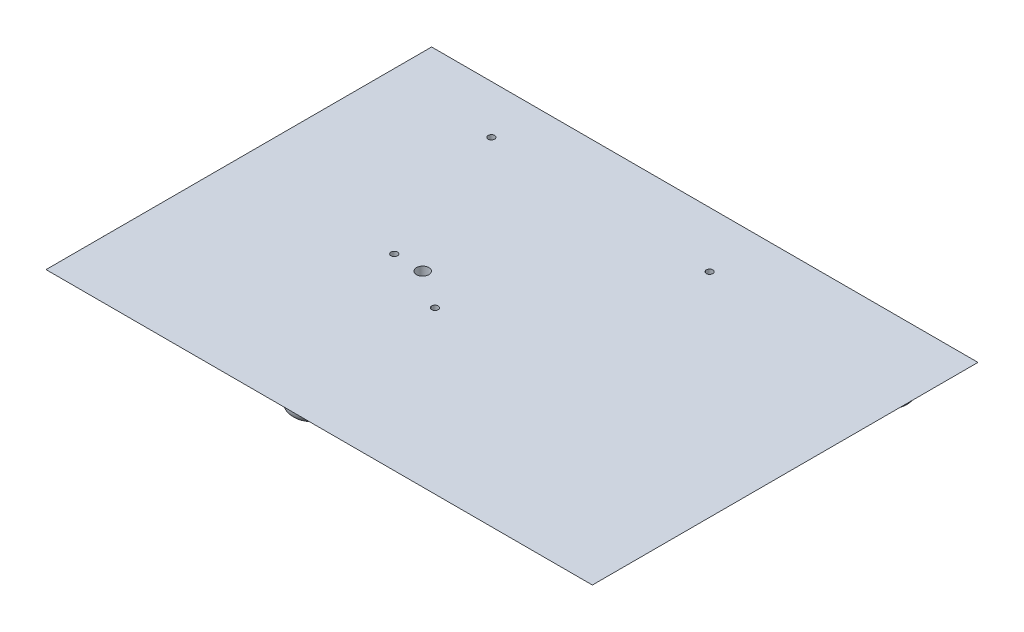
ISO-10303-21;
HEADER;
FILE_DESCRIPTION(('STEP AP214'),'2;1');
FILE_NAME('part.step','',(''),(''),'','','');
FILE_SCHEMA(('AUTOMOTIVE_DESIGN { 1 0 10303 214 1 1 1 1 }'));
ENDSEC;
DATA;
#1=APPLICATION_CONTEXT('core data for automotive mechanical design processes');
#2=APPLICATION_PROTOCOL_DEFINITION('international standard','automotive_design',2000,#1);
#3=PRODUCT_CONTEXT('',#1,'mechanical');
#4=PRODUCT('Part','Part','',(#3));
#5=PRODUCT_RELATED_PRODUCT_CATEGORY('part','',(#4));
#6=PRODUCT_DEFINITION_FORMATION('','',#4);
#7=PRODUCT_DEFINITION_CONTEXT('part definition',#1,'design');
#8=PRODUCT_DEFINITION('design','',#6,#7);
#9=PRODUCT_DEFINITION_SHAPE('','',#8);
#10=(LENGTH_UNIT() NAMED_UNIT(*) SI_UNIT(.MILLI.,.METRE.));
#11=(NAMED_UNIT(*) PLANE_ANGLE_UNIT() SI_UNIT($,.RADIAN.));
#12=(NAMED_UNIT(*) SI_UNIT($,.STERADIAN.) SOLID_ANGLE_UNIT());
#13=UNCERTAINTY_MEASURE_WITH_UNIT(LENGTH_MEASURE(1.E-05),#10,'distance_accuracy_value','');
#14=(GEOMETRIC_REPRESENTATION_CONTEXT(3) GLOBAL_UNCERTAINTY_ASSIGNED_CONTEXT((#13)) GLOBAL_UNIT_ASSIGNED_CONTEXT((#10,
#11,#12)) REPRESENTATION_CONTEXT('',''));
#15=CARTESIAN_POINT('',(0.,0.,0.));
#16=DIRECTION('',(0.,0.,1.));
#17=DIRECTION('',(1.,0.,0.));
#18=AXIS2_PLACEMENT_3D('',#15,#16,#17);
#19=CARTESIAN_POINT('',(0.,0.,0.));
#20=DIRECTION('',(0.,-1.,0.));
#21=DIRECTION('',(0.,0.,-1.));
#22=AXIS2_PLACEMENT_3D('',#19,#20,#21);
#23=PLANE('',#22);
#24=CARTESIAN_POINT('',(0.243499550899023,0.,-11.7520668416682));
#25=DIRECTION('',(0.,-1.,0.));
#26=DIRECTION('',(0.,0.,-1.));
#27=AXIS2_PLACEMENT_3D('',#24,#25,#26);
#28=CIRCLE('',#27,9.9);
#29=CARTESIAN_POINT('',(0.243499550899023,0.,-21.6520668416682));
#30=VERTEX_POINT('',#29);
#31=EDGE_CURVE('E336',#30,#30,#28,.T.);
#32=ORIENTED_EDGE('',*,*,#31,.F.);
#33=EDGE_LOOP('',(#32));
#34=FACE_BOUND('',#33,.T.);
#35=CARTESIAN_POINT('',(78.4618535037038,0.,130.95272228954));
#36=DIRECTION('',(0.,-1.,0.));
#37=DIRECTION('',(0.,0.,-1.));
#38=AXIS2_PLACEMENT_3D('',#35,#36,#37);
#39=CIRCLE('',#38,9.9);
#40=CARTESIAN_POINT('',(78.4618535037038,0.,121.05272228954));
#41=VERTEX_POINT('',#40);
#42=EDGE_CURVE('E332',#41,#41,#39,.T.);
#43=ORIENTED_EDGE('',*,*,#42,.F.);
#44=EDGE_LOOP('',(#43));
#45=FACE_BOUND('',#44,.T.);
#46=CARTESIAN_POINT('',(210.683499550899,0.,-11.7520668416682));
#47=DIRECTION('',(0.,-1.,0.));
#48=DIRECTION('',(0.,0.,-1.));
#49=AXIS2_PLACEMENT_3D('',#46,#47,#48);
#50=CIRCLE('',#49,9.89999999999998);
#51=CARTESIAN_POINT('',(210.683499550899,0.,-21.6520668416682));
#52=VERTEX_POINT('',#51);
#53=EDGE_CURVE('E317',#52,#52,#50,.T.);
#54=ORIENTED_EDGE('',*,*,#53,.F.);
#55=EDGE_LOOP('',(#54));
#56=FACE_BOUND('',#55,.T.);
#57=CARTESIAN_POINT('',(84.013499550899,0.,77.7455088721633));
#58=DIRECTION('',(0.,1.,0.));
#59=DIRECTION('',(0.,0.,1.));
#60=AXIS2_PLACEMENT_3D('',#57,#58,#59);
#61=CIRCLE('',#60,1.56379290432816);
#62=CARTESIAN_POINT('',(84.013499550899,0.,79.3093017764915));
#63=VERTEX_POINT('',#62);
#64=EDGE_CURVE('E328',#63,#63,#61,.T.);
#65=ORIENTED_EDGE('',*,*,#64,.T.);
#66=EDGE_LOOP('',(#65));
#67=FACE_BOUND('',#66,.T.);
#68=CARTESIAN_POINT('',(134.473825946548,0.,-2.47404936094142));
#69=DIRECTION('',(0.,1.,0.));
#70=DIRECTION('',(0.,0.,1.));
#71=AXIS2_PLACEMENT_3D('',#68,#69,#70);
#72=CIRCLE('',#71,1.56);
#73=CARTESIAN_POINT('',(134.473825946548,0.,-0.914049360941417));
#74=VERTEX_POINT('',#73);
#75=EDGE_CURVE('E323',#74,#74,#72,.T.);
#76=ORIENTED_EDGE('',*,*,#75,.T.);
#77=EDGE_LOOP('',(#76));
#78=FACE_BOUND('',#77,.T.);
#79=CARTESIAN_POINT('',(65.974334740333,0.,65.5479331583318));
#80=DIRECTION('',(0.,-1.,0.));
#81=DIRECTION('',(0.,0.,-1.));
#82=AXIS2_PLACEMENT_3D('',#79,#80,#81);
#83=CIRCLE('',#82,5.43);
#84=CARTESIAN_POINT('',(65.974334740333,0.,60.1179331583318));
#85=VERTEX_POINT('',#84);
#86=EDGE_CURVE('E313',#85,#85,#83,.T.);
#87=ORIENTED_EDGE('',*,*,#86,.F.);
#88=EDGE_LOOP('',(#87));
#89=FACE_BOUND('',#88,.T.);
#90=CARTESIAN_POINT('',(52.1254035342072,0.,65.2409534743744));
#91=DIRECTION('',(0.,-1.,0.));
#92=DIRECTION('',(0.,0.,-1.));
#93=AXIS2_PLACEMENT_3D('',#90,#91,#92);
#94=CIRCLE('',#93,3.67500000000002);
#95=CARTESIAN_POINT('',(52.1254035342072,0.,61.5659534743744));
#96=VERTEX_POINT('',#95);
#97=EDGE_CURVE('E260',#96,#96,#94,.T.);
#98=ORIENTED_EDGE('',*,*,#97,.F.);
#99=EDGE_LOOP('',(#98));
#100=FACE_BOUND('',#99,.T.);
#101=DIRECTION('',(0.,0.,-1.));
#102=VECTOR('',#101,1.);
#103=CARTESIAN_POINT('',(30.7649196414561,0.,0.));
#104=LINE('',#103,#102);
#105=CARTESIAN_POINT('',(30.7649196414561,0.,-5.2203576567237));
#106=VERTEX_POINT('',#105);
#107=CARTESIAN_POINT('',(30.7649196414561,0.,-6.68377602661267));
#108=VERTEX_POINT('',#107);
#109=EDGE_CURVE('E128',#106,#108,#104,.T.);
#110=ORIENTED_EDGE('',*,*,#109,.T.);
#111=CARTESIAN_POINT('',(27.163499550899,0.,-5.95206684166818));
#112=DIRECTION('',(0.,1.,0.));
#113=DIRECTION('',(0.,0.,1.));
#114=AXIS2_PLACEMENT_3D('',#111,#112,#113);
#115=CIRCLE('',#114,3.675);
#116=EDGE_CURVE('E64',#108,#106,#115,.T.);
#117=ORIENTED_EDGE('',*,*,#116,.T.);
#118=EDGE_LOOP('',(#110,#117));
#119=FACE_BOUND('',#118,.T.);
#120=DIRECTION('',(1.,0.,0.));
#121=VECTOR('',#120,1.);
#122=CARTESIAN_POINT('',(-18.536500449101,0.,-26.9520668416681));
#123=LINE('',#122,#121);
#124=CARTESIAN_POINT('',(-18.536500449101,0.,-26.9520668416681));
#125=VERTEX_POINT('',#124);
#126=CARTESIAN_POINT('',(229.463499550899,0.,-26.9520668416681));
#127=VERTEX_POINT('',#126);
#128=EDGE_CURVE('E300',#125,#127,#123,.T.);
#129=ORIENTED_EDGE('',*,*,#128,.T.);
#130=DIRECTION('',(0.,0.,1.));
#131=VECTOR('',#130,1.);
#132=CARTESIAN_POINT('',(229.463499550899,0.,-26.9520668416681));
#133=LINE('',#132,#131);
#134=CARTESIAN_POINT('',(229.463499550899,0.,148.047933158332));
#135=VERTEX_POINT('',#134);
#136=EDGE_CURVE('E292',#127,#135,#133,.T.);
#137=ORIENTED_EDGE('',*,*,#136,.T.);
#138=DIRECTION('',(1.,0.,0.));
#139=VECTOR('',#138,1.);
#140=CARTESIAN_POINT('',(-18.536500449101,0.,148.047933158332));
#141=LINE('',#140,#139);
#142=CARTESIAN_POINT('',(-18.536500449101,0.,148.047933158332));
#143=VERTEX_POINT('',#142);
#144=EDGE_CURVE('E261',#143,#135,#141,.T.);
#145=ORIENTED_EDGE('',*,*,#144,.F.);
#146=DIRECTION('',(0.,0.,1.));
#147=VECTOR('',#146,1.);
#148=CARTESIAN_POINT('',(-18.536500449101,0.,-26.9520668416681));
#149=LINE('',#148,#147);
#150=EDGE_CURVE('E72',#125,#143,#149,.T.);
#151=ORIENTED_EDGE('',*,*,#150,.F.);
#152=EDGE_LOOP('',(#129,#137,#145,#151));
#153=FACE_BOUND('',#152,.T.);
#154=ADVANCED_FACE('F49',(#34,#45,#56,#67,#78,#89,#100,#119,#153),#23,.T.);
#155=CARTESIAN_POINT('',(0.,6.,0.));
#156=DIRECTION('',(0.,1.,0.));
#157=DIRECTION('',(0.,0.,1.));
#158=AXIS2_PLACEMENT_3D('',#155,#156,#157);
#159=PLANE('',#158);
#160=CARTESIAN_POINT('',(84.013499550899,6.,77.7455088721633));
#161=DIRECTION('',(0.,1.,0.));
#162=DIRECTION('',(0.,0.,1.));
#163=AXIS2_PLACEMENT_3D('',#160,#161,#162);
#164=CIRCLE('',#163,1.56379290432816);
#165=CARTESIAN_POINT('',(84.013499550899,6.,79.3093017764915));
#166=VERTEX_POINT('',#165);
#167=EDGE_CURVE('E324',#166,#166,#164,.F.);
#168=ORIENTED_EDGE('',*,*,#167,.T.);
#169=EDGE_LOOP('',(#168));
#170=FACE_BOUND('',#169,.T.);
#171=CARTESIAN_POINT('',(134.473825946548,6.,-2.47404936094142));
#172=DIRECTION('',(0.,1.,0.));
#173=DIRECTION('',(0.,0.,1.));
#174=AXIS2_PLACEMENT_3D('',#171,#172,#173);
#175=CIRCLE('',#174,1.56);
#176=CARTESIAN_POINT('',(134.473825946548,6.,-0.914049360941417));
#177=VERTEX_POINT('',#176);
#178=EDGE_CURVE('E318',#177,#177,#175,.F.);
#179=ORIENTED_EDGE('',*,*,#178,.T.);
#180=EDGE_LOOP('',(#179));
#181=FACE_BOUND('',#180,.T.);
#182=CARTESIAN_POINT('',(27.163499550899,6.,-5.95206684166818));
#183=DIRECTION('',(0.,1.,0.));
#184=DIRECTION('',(0.,0.,1.));
#185=AXIS2_PLACEMENT_3D('',#182,#183,#184);
#186=CIRCLE('',#185,1.56);
#187=CARTESIAN_POINT('',(27.163499550899,6.,-4.39206684166818));
#188=VERTEX_POINT('',#187);
#189=EDGE_CURVE('E137',#188,#188,#186,.T.);
#190=ORIENTED_EDGE('',*,*,#189,.F.);
#191=EDGE_LOOP('',(#190));
#192=FACE_BOUND('',#191,.T.);
#193=CARTESIAN_POINT('',(65.974334740333,6.,65.5479331583318));
#194=DIRECTION('',(0.,1.,0.));
#195=DIRECTION('',(0.,0.,1.));
#196=AXIS2_PLACEMENT_3D('',#193,#194,#195);
#197=CIRCLE('',#196,2.94691911101702);
#198=CARTESIAN_POINT('',(65.974334740333,6.,68.4948522693488));
#199=VERTEX_POINT('',#198);
#200=EDGE_CURVE('E135',#199,#199,#197,.T.);
#201=ORIENTED_EDGE('',*,*,#200,.F.);
#202=EDGE_LOOP('',(#201));
#203=FACE_BOUND('',#202,.T.);
#204=CARTESIAN_POINT('',(52.1254035342072,6.,65.2409534743744));
#205=DIRECTION('',(0.,1.,0.));
#206=DIRECTION('',(0.,0.,1.));
#207=AXIS2_PLACEMENT_3D('',#204,#205,#206);
#208=CIRCLE('',#207,1.56416969477706);
#209=CARTESIAN_POINT('',(52.1254035342072,6.,66.8051231691515));
#210=VERTEX_POINT('',#209);
#211=EDGE_CURVE('E141',#210,#210,#208,.T.);
#212=ORIENTED_EDGE('',*,*,#211,.F.);
#213=EDGE_LOOP('',(#212));
#214=FACE_BOUND('',#213,.T.);
#215=DIRECTION('',(0.,0.,1.));
#216=VECTOR('',#215,1.);
#217=CARTESIAN_POINT('',(-24.2854326907217,6.,154.54079231546));
#218=LINE('',#217,#216);
#219=CARTESIAN_POINT('',(-24.2854326907217,6.,-28.9592076845402));
#220=VERTEX_POINT('',#219);
#221=CARTESIAN_POINT('',(-24.2854326907217,6.,154.54079231546));
#222=VERTEX_POINT('',#221);
#223=EDGE_CURVE('E148',#220,#222,#218,.T.);
#224=ORIENTED_EDGE('',*,*,#223,.T.);
#225=DIRECTION('',(1.,0.,0.));
#226=VECTOR('',#225,1.);
#227=CARTESIAN_POINT('',(235.714567309278,6.,154.54079231546));
#228=LINE('',#227,#226);
#229=CARTESIAN_POINT('',(235.714567309278,6.,154.54079231546));
#230=VERTEX_POINT('',#229);
#231=EDGE_CURVE('E153',#222,#230,#228,.T.);
#232=ORIENTED_EDGE('',*,*,#231,.T.);
#233=DIRECTION('',(0.,0.,-1.));
#234=VECTOR('',#233,1.);
#235=CARTESIAN_POINT('',(235.714567309278,6.,154.54079231546));
#236=LINE('',#235,#234);
#237=CARTESIAN_POINT('',(235.714567309278,6.,-28.9592076845402));
#238=VERTEX_POINT('',#237);
#239=EDGE_CURVE('E197',#230,#238,#236,.T.);
#240=ORIENTED_EDGE('',*,*,#239,.T.);
#241=DIRECTION('',(-1.,0.,0.));
#242=VECTOR('',#241,1.);
#243=CARTESIAN_POINT('',(235.714567309278,6.,-28.9592076845402));
#244=LINE('',#243,#242);
#245=EDGE_CURVE('E236',#238,#220,#244,.T.);
#246=ORIENTED_EDGE('',*,*,#245,.T.);
#247=EDGE_LOOP('',(#224,#232,#240,#246));
#248=FACE_BOUND('',#247,.T.);
#249=ADVANCED_FACE('F210',(#170,#181,#192,#203,#214,#248),#159,.T.);
#250=CARTESIAN_POINT('',(110.031204318135,-114.635418954789,0.));
#251=DIRECTION('',(-0.692470261061307,0.721446420426136,0.));
#252=DIRECTION('',(-0.721446420426136,-0.692470261061307,0.));
#253=AXIS2_PLACEMENT_3D('',#250,#251,#252);
#254=PLANE('',#253);
#255=DIRECTION('',(-0.577336667217422,-0.554148529051084,-0.599668058543057));
#256=VECTOR('',#255,1.);
#257=CARTESIAN_POINT('',(235.714567309278,6.,154.54079231546));
#258=LINE('',#257,#256);
#259=EDGE_CURVE('E196',#230,#135,#258,.T.);
#260=ORIENTED_EDGE('',*,*,#259,.T.);
#261=ORIENTED_EDGE('',*,*,#136,.F.);
#262=DIRECTION('',(-0.702835540593864,-0.674606868228304,0.225671833017172));
#263=VECTOR('',#262,1.);
#264=CARTESIAN_POINT('',(235.714567309278,6.,-28.9592076845402));
#265=LINE('',#264,#263);
#266=EDGE_CURVE('E502',#238,#127,#265,.T.);
#267=ORIENTED_EDGE('',*,*,#266,.F.);
#268=ORIENTED_EDGE('',*,*,#239,.F.);
#269=EDGE_LOOP('',(#260,#261,#267,#268));
#270=FACE_BOUND('',#269,.T.);
#271=ADVANCED_FACE('F219',(#270),#254,.F.);
#272=CARTESIAN_POINT('',(0.,-8.10868849972943,-24.2395201966792));
#273=DIRECTION('',(0.,0.317243381230876,0.948344155391491));
#274=DIRECTION('',(0.,-0.948344155391491,0.317243381230876));
#275=AXIS2_PLACEMENT_3D('',#272,#273,#274);
#276=PLANE('',#275);
#277=ORIENTED_EDGE('',*,*,#266,.T.);
#278=ORIENTED_EDGE('',*,*,#128,.F.);
#279=DIRECTION('',(0.672498590587613,-0.701867994601402,0.234791319711528));
#280=VECTOR('',#279,1.);
#281=CARTESIAN_POINT('',(-24.2854326907217,6.,-28.9592076845402));
#282=LINE('',#281,#280);
#283=EDGE_CURVE('E494',#220,#125,#282,.T.);
#284=ORIENTED_EDGE('',*,*,#283,.F.);
#285=ORIENTED_EDGE('',*,*,#245,.F.);
#286=EDGE_LOOP('',(#277,#278,#284,#285));
#287=FACE_BOUND('',#286,.T.);
#288=ADVANCED_FACE('F172',(#287),#276,.F.);
#289=CARTESIAN_POINT('',(0.,-73.7939024504005,68.1923639474496));
#290=DIRECTION('',(0.,0.73443172803957,-0.678682574440225));
#291=DIRECTION('',(0.,0.678682574440225,0.73443172803957));
#292=AXIS2_PLACEMENT_3D('',#289,#290,#291);
#293=PLANE('',#292);
#294=DIRECTION('',(0.545155332398835,-0.568963393012764,-0.615699862732256));
#295=VECTOR('',#294,1.);
#296=CARTESIAN_POINT('',(-24.2854326907217,6.,154.54079231546));
#297=LINE('',#296,#295);
#298=EDGE_CURVE('E159',#222,#143,#297,.T.);
#299=ORIENTED_EDGE('',*,*,#298,.T.);
#300=ORIENTED_EDGE('',*,*,#144,.T.);
#301=ORIENTED_EDGE('',*,*,#259,.F.);
#302=ORIENTED_EDGE('',*,*,#231,.F.);
#303=EDGE_LOOP('',(#299,#300,#301,#302));
#304=FACE_BOUND('',#303,.T.);
#305=ADVANCED_FACE('F161',(#304),#293,.F.);
#306=CARTESIAN_POINT('',(-9.66418351200792,-9.25978936352028,0.));
#307=DIRECTION('',(-0.722052391989645,-0.691838379408105,0.));
#308=DIRECTION('',(0.691838379408105,-0.722052391989645,0.));
#309=AXIS2_PLACEMENT_3D('',#306,#307,#308);
#310=PLANE('',#309);
#311=ORIENTED_EDGE('',*,*,#283,.T.);
#312=ORIENTED_EDGE('',*,*,#150,.T.);
#313=ORIENTED_EDGE('',*,*,#298,.F.);
#314=ORIENTED_EDGE('',*,*,#223,.F.);
#315=EDGE_LOOP('',(#311,#312,#313,#314));
#316=FACE_BOUND('',#315,.T.);
#317=ADVANCED_FACE('F171',(#316),#310,.T.);
#318=CARTESIAN_POINT('',(52.1254035342072,6.,65.2409534743744));
#319=DIRECTION('',(0.,-1.,0.));
#320=DIRECTION('',(0.,0.,-1.));
#321=AXIS2_PLACEMENT_3D('',#318,#319,#320);
#322=CYLINDRICAL_SURFACE('',#321,1.56416969477706);
#323=ORIENTED_EDGE('',*,*,#211,.T.);
#324=EDGE_LOOP('',(#323));
#325=FACE_BOUND('',#324,.T.);
#326=CARTESIAN_POINT('',(52.1254035342072,-1.,65.2409534743744));
#327=DIRECTION('',(0.,1.,0.));
#328=DIRECTION('',(0.,0.,1.));
#329=AXIS2_PLACEMENT_3D('',#326,#327,#328);
#330=CIRCLE('',#329,1.56416969477706);
#331=CARTESIAN_POINT('',(52.1254035342072,-1.,66.8051231691515));
#332=VERTEX_POINT('',#331);
#333=EDGE_CURVE('E447',#332,#332,#330,.T.);
#334=ORIENTED_EDGE('',*,*,#333,.F.);
#335=EDGE_LOOP('',(#334));
#336=FACE_BOUND('',#335,.T.);
#337=ADVANCED_FACE('F221',(#325,#336),#322,.F.);
#338=CARTESIAN_POINT('',(65.974334740333,6.,65.5479331583318));
#339=DIRECTION('',(0.,-1.,0.));
#340=DIRECTION('',(0.,0.,-1.));
#341=AXIS2_PLACEMENT_3D('',#338,#339,#340);
#342=CYLINDRICAL_SURFACE('',#341,2.94691911101702);
#343=ORIENTED_EDGE('',*,*,#200,.T.);
#344=EDGE_LOOP('',(#343));
#345=FACE_BOUND('',#344,.T.);
#346=CARTESIAN_POINT('',(65.974334740333,-1.,65.5479331583318));
#347=DIRECTION('',(0.,1.,0.));
#348=DIRECTION('',(0.,0.,1.));
#349=AXIS2_PLACEMENT_3D('',#346,#347,#348);
#350=CIRCLE('',#349,2.94691911101702);
#351=CARTESIAN_POINT('',(65.974334740333,-1.,68.4948522693488));
#352=VERTEX_POINT('',#351);
#353=EDGE_CURVE('E322',#352,#352,#350,.T.);
#354=ORIENTED_EDGE('',*,*,#353,.F.);
#355=EDGE_LOOP('',(#354));
#356=FACE_BOUND('',#355,.T.);
#357=ADVANCED_FACE('F430',(#345,#356),#342,.F.);
#358=CARTESIAN_POINT('',(27.163499550899,6.,-5.95206684166818));
#359=DIRECTION('',(0.,-1.,0.));
#360=DIRECTION('',(0.,0.,-1.));
#361=AXIS2_PLACEMENT_3D('',#358,#359,#360);
#362=CYLINDRICAL_SURFACE('',#361,1.56);
#363=ORIENTED_EDGE('',*,*,#189,.T.);
#364=EDGE_LOOP('',(#363));
#365=FACE_BOUND('',#364,.T.);
#366=CARTESIAN_POINT('',(27.163499550899,-1.,-5.95206684166818));
#367=DIRECTION('',(0.,1.,0.));
#368=DIRECTION('',(0.,0.,1.));
#369=AXIS2_PLACEMENT_3D('',#366,#367,#368);
#370=CIRCLE('',#369,1.56);
#371=CARTESIAN_POINT('',(27.163499550899,-1.,-4.39206684166818));
#372=VERTEX_POINT('',#371);
#373=EDGE_CURVE('E121',#372,#372,#370,.T.);
#374=ORIENTED_EDGE('',*,*,#373,.F.);
#375=EDGE_LOOP('',(#374));
#376=FACE_BOUND('',#375,.T.);
#377=ADVANCED_FACE('F428',(#365,#376),#362,.F.);
#378=CARTESIAN_POINT('',(30.7649196414561,-1.,0.));
#379=DIRECTION('',(1.,0.,0.));
#380=DIRECTION('',(0.,0.,-1.));
#381=AXIS2_PLACEMENT_3D('',#378,#379,#380);
#382=PLANE('',#381);
#383=ORIENTED_EDGE('',*,*,#109,.F.);
#384=DIRECTION('',(0.,1.,0.));
#385=VECTOR('',#384,1.);
#386=CARTESIAN_POINT('',(30.7649196414561,-1.,-5.2203576567237));
#387=LINE('',#386,#385);
#388=CARTESIAN_POINT('',(30.7649196414561,-1.,-5.2203576567237));
#389=VERTEX_POINT('',#388);
#390=EDGE_CURVE('E114',#389,#106,#387,.T.);
#391=ORIENTED_EDGE('',*,*,#390,.F.);
#392=DIRECTION('',(0.,0.,-1.));
#393=VECTOR('',#392,1.);
#394=CARTESIAN_POINT('',(30.7649196414561,-1.,0.));
#395=LINE('',#394,#393);
#396=CARTESIAN_POINT('',(30.7649196414561,-1.,-6.68377602661267));
#397=VERTEX_POINT('',#396);
#398=EDGE_CURVE('E117',#389,#397,#395,.T.);
#399=ORIENTED_EDGE('',*,*,#398,.T.);
#400=DIRECTION('',(0.,1.,0.));
#401=VECTOR('',#400,1.);
#402=CARTESIAN_POINT('',(30.7649196414561,-1.,-6.68377602661267));
#403=LINE('',#402,#401);
#404=EDGE_CURVE('E106',#397,#108,#403,.T.);
#405=ORIENTED_EDGE('',*,*,#404,.T.);
#406=EDGE_LOOP('',(#383,#391,#399,#405));
#407=FACE_BOUND('',#406,.T.);
#408=ADVANCED_FACE('F118',(#407),#382,.T.);
#409=CARTESIAN_POINT('',(27.163499550899,-1.,-5.95206684166818));
#410=DIRECTION('',(0.,1.,0.));
#411=DIRECTION('',(0.,0.,1.));
#412=AXIS2_PLACEMENT_3D('',#409,#410,#411);
#413=CYLINDRICAL_SURFACE('',#412,3.675);
#414=ORIENTED_EDGE('',*,*,#116,.F.);
#415=ORIENTED_EDGE('',*,*,#404,.F.);
#416=CARTESIAN_POINT('',(27.163499550899,-1.,-5.95206684166818));
#417=DIRECTION('',(0.,1.,0.));
#418=DIRECTION('',(0.,0.,1.));
#419=AXIS2_PLACEMENT_3D('',#416,#417,#418);
#420=CIRCLE('',#419,3.675);
#421=EDGE_CURVE('E110',#397,#389,#420,.T.);
#422=ORIENTED_EDGE('',*,*,#421,.T.);
#423=ORIENTED_EDGE('',*,*,#390,.T.);
#424=EDGE_LOOP('',(#414,#415,#422,#423));
#425=FACE_BOUND('',#424,.T.);
#426=ADVANCED_FACE('F108',(#425),#413,.T.);
#427=CARTESIAN_POINT('',(0.,-1.,0.));
#428=DIRECTION('',(0.,1.,0.));
#429=DIRECTION('',(0.,0.,1.));
#430=AXIS2_PLACEMENT_3D('',#427,#428,#429);
#431=PLANE('',#430);
#432=ORIENTED_EDGE('',*,*,#373,.T.);
#433=EDGE_LOOP('',(#432));
#434=FACE_BOUND('',#433,.T.);
#435=ORIENTED_EDGE('',*,*,#398,.F.);
#436=ORIENTED_EDGE('',*,*,#421,.F.);
#437=EDGE_LOOP('',(#435,#436));
#438=FACE_BOUND('',#437,.T.);
#439=ADVANCED_FACE('F123',(#434,#438),#431,.F.);
#440=CARTESIAN_POINT('',(52.1254035342072,-1.,65.2409534743744));
#441=DIRECTION('',(0.,1.,0.));
#442=DIRECTION('',(0.,0.,1.));
#443=AXIS2_PLACEMENT_3D('',#440,#441,#442);
#444=CYLINDRICAL_SURFACE('',#443,3.67500000000002);
#445=CARTESIAN_POINT('',(52.1254035342072,-1.,65.2409534743744));
#446=DIRECTION('',(0.,1.,0.));
#447=DIRECTION('',(0.,0.,1.));
#448=AXIS2_PLACEMENT_3D('',#445,#446,#447);
#449=CIRCLE('',#448,3.67500000000002);
#450=CARTESIAN_POINT('',(52.1254035342072,-1.,68.9159534743744));
#451=VERTEX_POINT('',#450);
#452=EDGE_CURVE('E131',#451,#451,#449,.T.);
#453=ORIENTED_EDGE('',*,*,#452,.T.);
#454=EDGE_LOOP('',(#453));
#455=FACE_BOUND('',#454,.T.);
#456=ORIENTED_EDGE('',*,*,#97,.T.);
#457=EDGE_LOOP('',(#456));
#458=FACE_BOUND('',#457,.T.);
#459=ADVANCED_FACE('F416',(#455,#458),#444,.T.);
#460=CARTESIAN_POINT('',(0.,-1.,0.));
#461=DIRECTION('',(0.,1.,0.));
#462=DIRECTION('',(0.,0.,1.));
#463=AXIS2_PLACEMENT_3D('',#460,#461,#462);
#464=PLANE('',#463);
#465=ORIENTED_EDGE('',*,*,#333,.T.);
#466=EDGE_LOOP('',(#465));
#467=FACE_BOUND('',#466,.T.);
#468=ORIENTED_EDGE('',*,*,#452,.F.);
#469=EDGE_LOOP('',(#468));
#470=FACE_BOUND('',#469,.T.);
#471=ADVANCED_FACE('F412',(#467,#470),#464,.F.);
#472=CARTESIAN_POINT('',(65.974334740333,-1.,65.5479331583318));
#473=DIRECTION('',(0.,1.,0.));
#474=DIRECTION('',(0.,0.,1.));
#475=AXIS2_PLACEMENT_3D('',#472,#473,#474);
#476=CYLINDRICAL_SURFACE('',#475,5.43);
#477=CARTESIAN_POINT('',(65.974334740333,-1.,65.5479331583318));
#478=DIRECTION('',(0.,1.,0.));
#479=DIRECTION('',(0.,0.,1.));
#480=AXIS2_PLACEMENT_3D('',#477,#478,#479);
#481=CIRCLE('',#480,5.43);
#482=CARTESIAN_POINT('',(65.974334740333,-1.,70.9779331583318));
#483=VERTEX_POINT('',#482);
#484=EDGE_CURVE('E443',#483,#483,#481,.T.);
#485=ORIENTED_EDGE('',*,*,#484,.T.);
#486=EDGE_LOOP('',(#485));
#487=FACE_BOUND('',#486,.T.);
#488=ORIENTED_EDGE('',*,*,#86,.T.);
#489=EDGE_LOOP('',(#488));
#490=FACE_BOUND('',#489,.T.);
#491=ADVANCED_FACE('F408',(#487,#490),#476,.T.);
#492=CARTESIAN_POINT('',(0.,-1.,0.));
#493=DIRECTION('',(0.,1.,0.));
#494=DIRECTION('',(0.,0.,1.));
#495=AXIS2_PLACEMENT_3D('',#492,#493,#494);
#496=PLANE('',#495);
#497=ORIENTED_EDGE('',*,*,#353,.T.);
#498=EDGE_LOOP('',(#497));
#499=FACE_BOUND('',#498,.T.);
#500=ORIENTED_EDGE('',*,*,#484,.F.);
#501=EDGE_LOOP('',(#500));
#502=FACE_BOUND('',#501,.T.);
#503=ADVANCED_FACE('F404',(#499,#502),#496,.F.);
#504=CARTESIAN_POINT('',(134.473825946548,10.,-2.47404936094142));
#505=DIRECTION('',(0.,-1.,0.));
#506=DIRECTION('',(0.,0.,-1.));
#507=AXIS2_PLACEMENT_3D('',#504,#505,#506);
#508=CYLINDRICAL_SURFACE('',#507,1.56);
#509=ORIENTED_EDGE('',*,*,#178,.F.);
#510=EDGE_LOOP('',(#509));
#511=FACE_BOUND('',#510,.T.);
#512=ORIENTED_EDGE('',*,*,#75,.F.);
#513=EDGE_LOOP('',(#512));
#514=FACE_BOUND('',#513,.T.);
#515=ADVANCED_FACE('F400',(#511,#514),#508,.F.);
#516=CARTESIAN_POINT('',(84.013499550899,10.,77.7455088721633));
#517=DIRECTION('',(0.,-1.,0.));
#518=DIRECTION('',(0.,0.,-1.));
#519=AXIS2_PLACEMENT_3D('',#516,#517,#518);
#520=CYLINDRICAL_SURFACE('',#519,1.56379290432816);
#521=ORIENTED_EDGE('',*,*,#167,.F.);
#522=EDGE_LOOP('',(#521));
#523=FACE_BOUND('',#522,.T.);
#524=ORIENTED_EDGE('',*,*,#64,.F.);
#525=EDGE_LOOP('',(#524));
#526=FACE_BOUND('',#525,.T.);
#527=ADVANCED_FACE('F396',(#523,#526),#520,.F.);
#528=CARTESIAN_POINT('',(210.683499550899,-12.5,-11.7520668416682));
#529=DIRECTION('',(0.,1.,0.));
#530=DIRECTION('',(0.,0.,1.));
#531=AXIS2_PLACEMENT_3D('',#528,#529,#530);
#532=CYLINDRICAL_SURFACE('',#531,9.89999999999998);
#533=CARTESIAN_POINT('',(210.683499550899,-7.5,-11.7520668416682));
#534=DIRECTION('',(0.,1.,0.));
#535=DIRECTION('',(0.,0.,1.));
#536=AXIS2_PLACEMENT_3D('',#533,#534,#535);
#537=CIRCLE('',#536,9.89999999999998);
#538=CARTESIAN_POINT('',(210.683499550899,-7.5,-1.85206684166819));
#539=VERTEX_POINT('',#538);
#540=EDGE_CURVE('E348',#539,#539,#537,.T.);
#541=ORIENTED_EDGE('',*,*,#540,.T.);
#542=EDGE_LOOP('',(#541));
#543=FACE_BOUND('',#542,.T.);
#544=ORIENTED_EDGE('',*,*,#53,.T.);
#545=EDGE_LOOP('',(#544));
#546=FACE_BOUND('',#545,.T.);
#547=ADVANCED_FACE('F392',(#543,#546),#532,.T.);
#548=CARTESIAN_POINT('',(0.,-12.5,0.));
#549=DIRECTION('',(0.,1.,0.));
#550=DIRECTION('',(0.,0.,1.));
#551=AXIS2_PLACEMENT_3D('',#548,#549,#550);
#552=PLANE('',#551);
#553=CARTESIAN_POINT('',(210.683499550899,-12.5,-11.7520668416682));
#554=DIRECTION('',(0.,1.,0.));
#555=DIRECTION('',(0.,0.,1.));
#556=AXIS2_PLACEMENT_3D('',#553,#554,#555);
#557=CIRCLE('',#556,4.89999999999999);
#558=CARTESIAN_POINT('',(210.683499550899,-12.5,-6.85206684166819));
#559=VERTEX_POINT('',#558);
#560=EDGE_CURVE('E352',#559,#559,#557,.F.);
#561=ORIENTED_EDGE('',*,*,#560,.T.);
#562=EDGE_LOOP('',(#561));
#563=FACE_BOUND('',#562,.T.);
#564=ADVANCED_FACE('F385',(#563),#552,.F.);
#565=CARTESIAN_POINT('',(78.4618535037038,-12.5,130.95272228954));
#566=DIRECTION('',(0.,1.,0.));
#567=DIRECTION('',(0.,0.,1.));
#568=AXIS2_PLACEMENT_3D('',#565,#566,#567);
#569=CYLINDRICAL_SURFACE('',#568,9.9);
#570=CARTESIAN_POINT('',(78.4618535037038,-7.5,130.95272228954));
#571=DIRECTION('',(0.,1.,0.));
#572=DIRECTION('',(0.,0.,1.));
#573=AXIS2_PLACEMENT_3D('',#570,#571,#572);
#574=CIRCLE('',#573,9.9);
#575=CARTESIAN_POINT('',(78.4618535037038,-7.5,140.85272228954));
#576=VERTEX_POINT('',#575);
#577=EDGE_CURVE('E340',#576,#576,#574,.T.);
#578=ORIENTED_EDGE('',*,*,#577,.T.);
#579=EDGE_LOOP('',(#578));
#580=FACE_BOUND('',#579,.T.);
#581=ORIENTED_EDGE('',*,*,#42,.T.);
#582=EDGE_LOOP('',(#581));
#583=FACE_BOUND('',#582,.T.);
#584=ADVANCED_FACE('F382',(#580,#583),#569,.T.);
#585=CARTESIAN_POINT('',(0.,-12.5,0.));
#586=DIRECTION('',(0.,1.,0.));
#587=DIRECTION('',(0.,0.,1.));
#588=AXIS2_PLACEMENT_3D('',#585,#586,#587);
#589=PLANE('',#588);
#590=CARTESIAN_POINT('',(78.4618535037038,-12.5,130.95272228954));
#591=DIRECTION('',(0.,1.,0.));
#592=DIRECTION('',(0.,0.,1.));
#593=AXIS2_PLACEMENT_3D('',#590,#591,#592);
#594=CIRCLE('',#593,4.9);
#595=CARTESIAN_POINT('',(78.4618535037038,-12.5,135.85272228954));
#596=VERTEX_POINT('',#595);
#597=EDGE_CURVE('E344',#596,#596,#594,.F.);
#598=ORIENTED_EDGE('',*,*,#597,.T.);
#599=EDGE_LOOP('',(#598));
#600=FACE_BOUND('',#599,.T.);
#601=ADVANCED_FACE('F379',(#600),#589,.F.);
#602=CARTESIAN_POINT('',(0.243499550899023,-12.5,-11.7520668416682));
#603=DIRECTION('',(0.,1.,0.));
#604=DIRECTION('',(0.,0.,1.));
#605=AXIS2_PLACEMENT_3D('',#602,#603,#604);
#606=CYLINDRICAL_SURFACE('',#605,9.9);
#607=CARTESIAN_POINT('',(0.243499550899023,-7.5,-11.7520668416682));
#608=DIRECTION('',(0.,1.,0.));
#609=DIRECTION('',(0.,0.,1.));
#610=AXIS2_PLACEMENT_3D('',#607,#608,#609);
#611=CIRCLE('',#610,9.9);
#612=CARTESIAN_POINT('',(0.243499550899023,-7.5,-1.85206684166817));
#613=VERTEX_POINT('',#612);
#614=EDGE_CURVE('E58',#613,#613,#611,.T.);
#615=ORIENTED_EDGE('',*,*,#614,.T.);
#616=EDGE_LOOP('',(#615));
#617=FACE_BOUND('',#616,.T.);
#618=ORIENTED_EDGE('',*,*,#31,.T.);
#619=EDGE_LOOP('',(#618));
#620=FACE_BOUND('',#619,.T.);
#621=ADVANCED_FACE('F359',(#617,#620),#606,.T.);
#622=CARTESIAN_POINT('',(0.243499550899023,-12.5,-11.7520668416682));
#623=DIRECTION('',(0.,1.,0.));
#624=DIRECTION('',(0.,0.,1.));
#625=AXIS2_PLACEMENT_3D('',#622,#623,#624);
#626=PLANE('',#625);
#627=CARTESIAN_POINT('',(0.243499550899023,-12.5,-11.7520668416682));
#628=DIRECTION('',(0.,1.,0.));
#629=DIRECTION('',(0.,0.,1.));
#630=AXIS2_PLACEMENT_3D('',#627,#628,#629);
#631=CIRCLE('',#630,4.9);
#632=CARTESIAN_POINT('',(0.243499550899023,-12.5,-6.85206684166817));
#633=VERTEX_POINT('',#632);
#634=EDGE_CURVE('E12',#633,#633,#631,.F.);
#635=ORIENTED_EDGE('',*,*,#634,.T.);
#636=EDGE_LOOP('',(#635));
#637=FACE_BOUND('',#636,.T.);
#638=ADVANCED_FACE('F371',(#637),#626,.F.);
#639=CARTESIAN_POINT('',(78.4618535037038,-7.5,130.95272228954));
#640=DIRECTION('',(0.,1.,0.));
#641=DIRECTION('',(0.,0.,1.));
#642=AXIS2_PLACEMENT_3D('',#639,#640,#641);
#643=DEGENERATE_TOROIDAL_SURFACE('',#642,4.9,5.,.T.);
#644=ORIENTED_EDGE('',*,*,#597,.F.);
#645=EDGE_LOOP('',(#644));
#646=FACE_BOUND('',#645,.T.);
#647=ORIENTED_EDGE('',*,*,#577,.F.);
#648=EDGE_LOOP('',(#647));
#649=FACE_BOUND('',#648,.T.);
#650=ADVANCED_FACE('F279',(#646,#649),#643,.T.);
#651=CARTESIAN_POINT('',(210.683499550899,-7.5,-11.7520668416682));
#652=DIRECTION('',(0.,1.,0.));
#653=DIRECTION('',(0.,0.,1.));
#654=AXIS2_PLACEMENT_3D('',#651,#652,#653);
#655=DEGENERATE_TOROIDAL_SURFACE('',#654,4.89999999999999,5.,.T.);
#656=ORIENTED_EDGE('',*,*,#560,.F.);
#657=EDGE_LOOP('',(#656));
#658=FACE_BOUND('',#657,.T.);
#659=ORIENTED_EDGE('',*,*,#540,.F.);
#660=EDGE_LOOP('',(#659));
#661=FACE_BOUND('',#660,.T.);
#662=ADVANCED_FACE('F363',(#658,#661),#655,.T.);
#663=CARTESIAN_POINT('',(0.243499550899023,-7.5,-11.7520668416682));
#664=DIRECTION('',(0.,1.,0.));
#665=DIRECTION('',(0.,0.,1.));
#666=AXIS2_PLACEMENT_3D('',#663,#664,#665);
#667=DEGENERATE_TOROIDAL_SURFACE('',#666,4.9,5.,.T.);
#668=ORIENTED_EDGE('',*,*,#634,.F.);
#669=EDGE_LOOP('',(#668));
#670=FACE_BOUND('',#669,.T.);
#671=ORIENTED_EDGE('',*,*,#614,.F.);
#672=EDGE_LOOP('',(#671));
#673=FACE_BOUND('',#672,.T.);
#674=ADVANCED_FACE('F51',(#670,#673),#667,.T.);
#675=CLOSED_SHELL('',(#154,#249,#271,#288,#305,#317,#337,#357,#377,#408,#426,#439,#459,#471,
#491,#503,#515,#527,#547,#564,#584,#601,#621,#638,#650,#662,#674));
#676=MANIFOLD_SOLID_BREP('B2',#675);
#677=ADVANCED_BREP_SHAPE_REPRESENTATION('',(#18,#676),#14);
#678=SHAPE_DEFINITION_REPRESENTATION(#9,#677);
ENDSEC;
END-ISO-10303-21;
